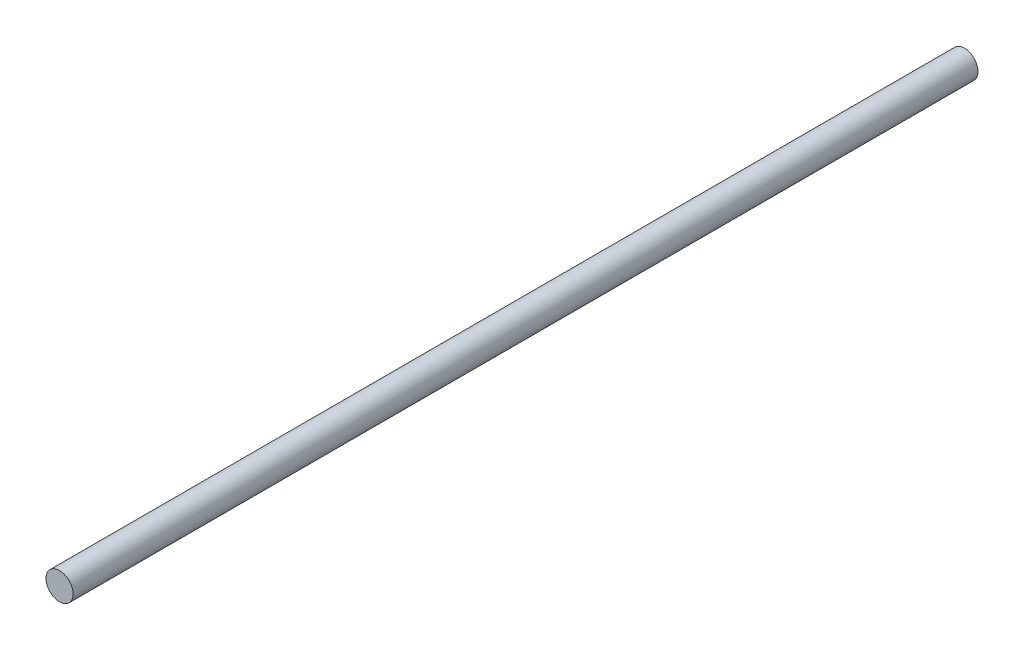
ISO-10303-21;
HEADER;
FILE_DESCRIPTION(('STEP AP214'),'2;1');
FILE_NAME('part.step','',(''),(''),'','','');
FILE_SCHEMA(('AUTOMOTIVE_DESIGN { 1 0 10303 214 1 1 1 1 }'));
ENDSEC;
DATA;
#1=APPLICATION_CONTEXT('core data for automotive mechanical design processes');
#2=APPLICATION_PROTOCOL_DEFINITION('international standard','automotive_design',2000,#1);
#3=PRODUCT_CONTEXT('',#1,'mechanical');
#4=PRODUCT('Part','Part','',(#3));
#5=PRODUCT_RELATED_PRODUCT_CATEGORY('part','',(#4));
#6=PRODUCT_DEFINITION_FORMATION('','',#4);
#7=PRODUCT_DEFINITION_CONTEXT('part definition',#1,'design');
#8=PRODUCT_DEFINITION('design','',#6,#7);
#9=PRODUCT_DEFINITION_SHAPE('','',#8);
#10=(LENGTH_UNIT() NAMED_UNIT(*) SI_UNIT(.MILLI.,.METRE.));
#11=(NAMED_UNIT(*) PLANE_ANGLE_UNIT() SI_UNIT($,.RADIAN.));
#12=(NAMED_UNIT(*) SI_UNIT($,.STERADIAN.) SOLID_ANGLE_UNIT());
#13=UNCERTAINTY_MEASURE_WITH_UNIT(LENGTH_MEASURE(1.E-05),#10,'distance_accuracy_value','');
#14=(GEOMETRIC_REPRESENTATION_CONTEXT(3) GLOBAL_UNCERTAINTY_ASSIGNED_CONTEXT((#13)) GLOBAL_UNIT_ASSIGNED_CONTEXT((#10,
#11,#12)) REPRESENTATION_CONTEXT('',''));
#15=CARTESIAN_POINT('',(0.,0.,0.));
#16=DIRECTION('',(0.,0.,1.));
#17=DIRECTION('',(1.,0.,0.));
#18=AXIS2_PLACEMENT_3D('',#15,#16,#17);
#19=CARTESIAN_POINT('',(0.,0.,100.));
#20=DIRECTION('',(0.,0.,-1.));
#21=DIRECTION('',(-1.,0.,0.));
#22=AXIS2_PLACEMENT_3D('',#19,#20,#21);
#23=CYLINDRICAL_SURFACE('',#22,1.5);
#24=CARTESIAN_POINT('',(0.,0.,100.));
#25=DIRECTION('',(0.,0.,1.));
#26=DIRECTION('',(1.,0.,0.));
#27=AXIS2_PLACEMENT_3D('',#24,#25,#26);
#28=CIRCLE('',#27,1.5);
#29=CARTESIAN_POINT('',(1.5,0.,100.));
#30=VERTEX_POINT('',#29);
#31=EDGE_CURVE('E10',#30,#30,#28,.T.);
#32=ORIENTED_EDGE('',*,*,#31,.F.);
#33=EDGE_LOOP('',(#32));
#34=FACE_BOUND('',#33,.T.);
#35=CARTESIAN_POINT('',(0.,0.,0.));
#36=DIRECTION('',(0.,0.,1.));
#37=DIRECTION('',(1.,0.,0.));
#38=AXIS2_PLACEMENT_3D('',#35,#36,#37);
#39=CIRCLE('',#38,1.5);
#40=CARTESIAN_POINT('',(1.5,0.,0.));
#41=VERTEX_POINT('',#40);
#42=EDGE_CURVE('E31',#41,#41,#39,.T.);
#43=ORIENTED_EDGE('',*,*,#42,.T.);
#44=EDGE_LOOP('',(#43));
#45=FACE_BOUND('',#44,.T.);
#46=ADVANCED_FACE('F28',(#34,#45),#23,.T.);
#47=CARTESIAN_POINT('',(0.,0.,100.));
#48=DIRECTION('',(0.,0.,1.));
#49=DIRECTION('',(1.,0.,0.));
#50=AXIS2_PLACEMENT_3D('',#47,#48,#49);
#51=PLANE('',#50);
#52=ORIENTED_EDGE('',*,*,#31,.T.);
#53=EDGE_LOOP('',(#52));
#54=FACE_BOUND('',#53,.T.);
#55=ADVANCED_FACE('F43',(#54),#51,.T.);
#56=CARTESIAN_POINT('',(0.,0.,0.));
#57=DIRECTION('',(0.,0.,1.));
#58=DIRECTION('',(1.,0.,0.));
#59=AXIS2_PLACEMENT_3D('',#56,#57,#58);
#60=PLANE('',#59);
#61=ORIENTED_EDGE('',*,*,#42,.F.);
#62=EDGE_LOOP('',(#61));
#63=FACE_BOUND('',#62,.T.);
#64=ADVANCED_FACE('F41',(#63),#60,.F.);
#65=CLOSED_SHELL('',(#46,#55,#64));
#66=MANIFOLD_SOLID_BREP('B2',#65);
#67=ADVANCED_BREP_SHAPE_REPRESENTATION('',(#18,#66),#14);
#68=SHAPE_DEFINITION_REPRESENTATION(#9,#67);
ENDSEC;
END-ISO-10303-21;
